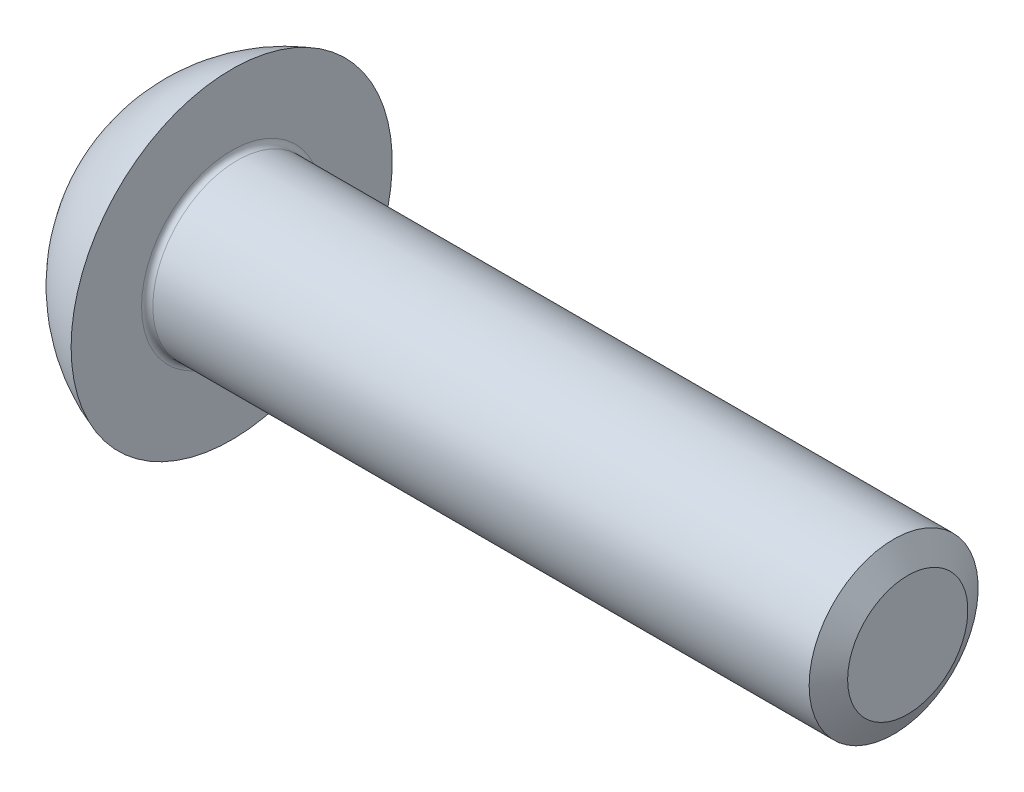
ISO-10303-21;
HEADER;
FILE_DESCRIPTION(('STEP AP214'),'2;1');
FILE_NAME('part.step','',(''),(''),'','','');
FILE_SCHEMA(('AUTOMOTIVE_DESIGN { 1 0 10303 214 1 1 1 1 }'));
ENDSEC;
DATA;
#1=APPLICATION_CONTEXT('core data for automotive mechanical design processes');
#2=APPLICATION_PROTOCOL_DEFINITION('international standard','automotive_design',2000,#1);
#3=PRODUCT_CONTEXT('',#1,'mechanical');
#4=PRODUCT('Part','Part','',(#3));
#5=PRODUCT_RELATED_PRODUCT_CATEGORY('part','',(#4));
#6=PRODUCT_DEFINITION_FORMATION('','',#4);
#7=PRODUCT_DEFINITION_CONTEXT('part definition',#1,'design');
#8=PRODUCT_DEFINITION('design','',#6,#7);
#9=PRODUCT_DEFINITION_SHAPE('','',#8);
#10=(LENGTH_UNIT() NAMED_UNIT(*) SI_UNIT(.MILLI.,.METRE.));
#11=(NAMED_UNIT(*) PLANE_ANGLE_UNIT() SI_UNIT($,.RADIAN.));
#12=(NAMED_UNIT(*) SI_UNIT($,.STERADIAN.) SOLID_ANGLE_UNIT());
#13=UNCERTAINTY_MEASURE_WITH_UNIT(LENGTH_MEASURE(1.E-05),#10,'distance_accuracy_value','');
#14=(GEOMETRIC_REPRESENTATION_CONTEXT(3) GLOBAL_UNCERTAINTY_ASSIGNED_CONTEXT((#13)) GLOBAL_UNIT_ASSIGNED_CONTEXT((#10,
#11,#12)) REPRESENTATION_CONTEXT('',''));
#15=CARTESIAN_POINT('',(0.,0.,0.));
#16=DIRECTION('',(0.,0.,1.));
#17=DIRECTION('',(1.,0.,0.));
#18=AXIS2_PLACEMENT_3D('',#15,#16,#17);
#19=CARTESIAN_POINT('',(-13.65,0.,0.));
#20=DIRECTION('',(-1.,0.,0.));
#21=DIRECTION('',(0.,0.,1.));
#22=AXIS2_PLACEMENT_3D('',#19,#20,#21);
#23=CYLINDRICAL_SURFACE('',#22,1.5);
#24=CARTESIAN_POINT('',(-11.9,0.,0.));
#25=DIRECTION('',(-1.,0.,0.));
#26=DIRECTION('',(0.,0.,1.));
#27=AXIS2_PLACEMENT_3D('',#24,#25,#26);
#28=CIRCLE('',#27,1.5);
#29=CARTESIAN_POINT('',(-11.9,0.,1.5));
#30=VERTEX_POINT('',#29);
#31=EDGE_CURVE('E262',#30,#30,#28,.T.);
#32=ORIENTED_EDGE('',*,*,#31,.F.);
#33=EDGE_LOOP('',(#32));
#34=FACE_BOUND('',#33,.T.);
#35=CARTESIAN_POINT('',(-0.25,0.,0.));
#36=DIRECTION('',(-1.,0.,0.));
#37=DIRECTION('',(0.,0.,1.));
#38=AXIS2_PLACEMENT_3D('',#35,#36,#37);
#39=CIRCLE('',#38,1.5);
#40=CARTESIAN_POINT('',(-0.25,0.,1.5));
#41=VERTEX_POINT('',#40);
#42=EDGE_CURVE('E449',#41,#41,#39,.T.);
#43=ORIENTED_EDGE('',*,*,#42,.T.);
#44=EDGE_LOOP('',(#43));
#45=FACE_BOUND('',#44,.T.);
#46=ADVANCED_FACE('F41',(#34,#45),#23,.T.);
#47=CARTESIAN_POINT('',(-13.65,0.,0.));
#48=DIRECTION('',(1.,0.,0.));
#49=DIRECTION('',(0.,0.,-1.));
#50=AXIS2_PLACEMENT_3D('',#47,#48,#49);
#51=PLANE('',#50);
#52=CARTESIAN_POINT('',(-13.65,0.,0.));
#53=DIRECTION('',(-1.,0.,0.));
#54=DIRECTION('',(0.,0.,1.));
#55=AXIS2_PLACEMENT_3D('',#52,#53,#54);
#56=CIRCLE('',#55,1.49999999999999);
#57=CARTESIAN_POINT('',(-13.65,0.,1.49999999999999));
#58=VERTEX_POINT('',#57);
#59=EDGE_CURVE('E254',#58,#58,#56,.T.);
#60=ORIENTED_EDGE('',*,*,#59,.T.);
#61=EDGE_LOOP('',(#60));
#62=FACE_BOUND('',#61,.T.);
#63=CARTESIAN_POINT('',(-13.65,0.,0.));
#64=DIRECTION('',(1.,0.,0.));
#65=DIRECTION('',(0.,0.,-1.));
#66=AXIS2_PLACEMENT_3D('',#63,#64,#65);
#67=CIRCLE('',#66,1.15470053837925);
#68=CARTESIAN_POINT('',(-13.65,-0.577350269189627,-1.));
#69=VERTEX_POINT('',#68);
#70=CARTESIAN_POINT('',(-13.65,-1.15470053837925,0.));
#71=VERTEX_POINT('',#70);
#72=EDGE_CURVE('E11',#69,#71,#67,.F.);
#73=ORIENTED_EDGE('',*,*,#72,.F.);
#74=CARTESIAN_POINT('',(-13.65,0.577350269189628,-1.));
#75=VERTEX_POINT('',#74);
#76=EDGE_CURVE('E45',#75,#69,#67,.F.);
#77=ORIENTED_EDGE('',*,*,#76,.F.);
#78=CARTESIAN_POINT('',(-13.65,1.15470053837925,0.));
#79=VERTEX_POINT('',#78);
#80=EDGE_CURVE('E114',#79,#75,#67,.F.);
#81=ORIENTED_EDGE('',*,*,#80,.F.);
#82=CARTESIAN_POINT('',(-13.65,0.577350269189629,1.));
#83=VERTEX_POINT('',#82);
#84=EDGE_CURVE('E327',#83,#79,#67,.F.);
#85=ORIENTED_EDGE('',*,*,#84,.F.);
#86=CARTESIAN_POINT('',(-13.65,-0.577350269189641,0.999999999999994));
#87=VERTEX_POINT('',#86);
#88=EDGE_CURVE('E50',#87,#83,#67,.F.);
#89=ORIENTED_EDGE('',*,*,#88,.F.);
#90=CARTESIAN_POINT('',(-13.65,0.,0.));
#91=DIRECTION('',(-1.,0.,0.));
#92=DIRECTION('',(0.,-1.,0.));
#93=AXIS2_PLACEMENT_3D('',#90,#91,#92);
#94=CIRCLE('',#93,1.15470053837925);
#95=EDGE_CURVE('E117',#71,#87,#94,.T.);
#96=ORIENTED_EDGE('',*,*,#95,.F.);
#97=EDGE_LOOP('',(#73,#77,#81,#85,#89,#96));
#98=FACE_BOUND('',#97,.T.);
#99=ADVANCED_FACE('F43',(#62,#98),#51,.F.);
#100=CARTESIAN_POINT('',(-11.0454545454545,0.,0.));
#101=DIRECTION('',(-1.,0.,0.));
#102=DIRECTION('',(0.,1.,0.));
#103=AXIS2_PLACEMENT_3D('',#100,#101,#102);
#104=SPHERICAL_SURFACE('',#103,3.00560426949281);
#105=ORIENTED_EDGE('',*,*,#59,.F.);
#106=EDGE_LOOP('',(#105));
#107=FACE_BOUND('',#106,.T.);
#108=CARTESIAN_POINT('',(-12.,0.,0.));
#109=DIRECTION('',(-1.,0.,0.));
#110=DIRECTION('',(0.,0.,1.));
#111=AXIS2_PLACEMENT_3D('',#108,#109,#110);
#112=CIRCLE('',#111,2.85);
#113=CARTESIAN_POINT('',(-12.,0.,2.85));
#114=VERTEX_POINT('',#113);
#115=EDGE_CURVE('E257',#114,#114,#112,.T.);
#116=ORIENTED_EDGE('',*,*,#115,.T.);
#117=EDGE_LOOP('',(#116));
#118=FACE_BOUND('',#117,.T.);
#119=ADVANCED_FACE('F243',(#107,#118),#104,.T.);
#120=CARTESIAN_POINT('',(-12.,1.6,0.));
#121=DIRECTION('',(-1.,0.,0.));
#122=DIRECTION('',(0.,0.,1.));
#123=AXIS2_PLACEMENT_3D('',#120,#121,#122);
#124=PLANE('',#123);
#125=ORIENTED_EDGE('',*,*,#115,.F.);
#126=EDGE_LOOP('',(#125));
#127=FACE_BOUND('',#126,.T.);
#128=CARTESIAN_POINT('',(-12.,0.,0.));
#129=DIRECTION('',(-1.,0.,0.));
#130=DIRECTION('',(0.,0.,1.));
#131=AXIS2_PLACEMENT_3D('',#128,#129,#130);
#132=CIRCLE('',#131,1.6);
#133=CARTESIAN_POINT('',(-12.,0.,1.6));
#134=VERTEX_POINT('',#133);
#135=EDGE_CURVE('E258',#134,#134,#132,.T.);
#136=ORIENTED_EDGE('',*,*,#135,.T.);
#137=EDGE_LOOP('',(#136));
#138=FACE_BOUND('',#137,.T.);
#139=ADVANCED_FACE('F240',(#127,#138),#124,.F.);
#140=CARTESIAN_POINT('',(-11.9,0.,0.));
#141=DIRECTION('',(-1.,0.,0.));
#142=DIRECTION('',(0.,0.,1.));
#143=AXIS2_PLACEMENT_3D('',#140,#141,#142);
#144=TOROIDAL_SURFACE('',#143,1.6,0.100000000000001);
#145=ORIENTED_EDGE('',*,*,#135,.F.);
#146=EDGE_LOOP('',(#145));
#147=FACE_BOUND('',#146,.T.);
#148=ORIENTED_EDGE('',*,*,#31,.T.);
#149=EDGE_LOOP('',(#148));
#150=FACE_BOUND('',#149,.T.);
#151=ADVANCED_FACE('F237',(#147,#150),#144,.F.);
#152=CARTESIAN_POINT('',(-13.35,0.,0.));
#153=DIRECTION('',(-1.,0.,0.));
#154=DIRECTION('',(0.,-1.,0.));
#155=AXIS2_PLACEMENT_3D('',#152,#153,#154);
#156=CONICAL_SURFACE('',#155,0.,1.31660847419537);
#157=CARTESIAN_POINT('',(-13.8201338061757,-1.50813004503231,-1.));
#158=CARTESIAN_POINT('',(-13.8103550434582,-1.46296169551439,-1.));
#159=CARTESIAN_POINT('',(-13.8007010634319,-1.41776633015547,-1.));
#160=CARTESIAN_POINT('',(-13.7817057249496,-1.32730802004726,-1.));
#161=CARTESIAN_POINT('',(-13.7723643798043,-1.28204507250605,-1.));
#162=CARTESIAN_POINT('',(-13.744887707109,-1.1460540932135,-1.));
#163=CARTESIAN_POINT('',(-13.727318593487,-1.05520983554783,-1.));
#164=CARTESIAN_POINT('',(-13.6946113120355,-0.873838301527071,-1.));
#165=CARTESIAN_POINT('',(-13.6794545669183,-0.783314439111171,-1.));
#166=CARTESIAN_POINT('',(-13.6526000869216,-0.601754544937859,-1.));
#167=CARTESIAN_POINT('',(-13.6409016960468,-0.510718613654571,-1.));
#168=CARTESIAN_POINT('',(-13.6224688104588,-0.327147289363389,-1.));
#169=CARTESIAN_POINT('',(-13.615787761882,-0.234606191530867,-1.));
#170=CARTESIAN_POINT('',(-13.6090368362792,-0.0493046546038913,-1.));
#171=CARTESIAN_POINT('',(-13.6089640024594,0.0434556678202338,-1.));
#172=CARTESIAN_POINT('',(-13.6154534933963,0.229083736297408,-1.));
#173=CARTESIAN_POINT('',(-13.6220414736928,0.321950510989412,-1.));
#174=CARTESIAN_POINT('',(-13.6404572139866,0.507192547661322,-1.));
#175=CARTESIAN_POINT('',(-13.6522884816114,0.599567438647767,-1.));
#176=CARTESIAN_POINT('',(-13.6798118313046,0.785811374344476,-1.));
#177=CARTESIAN_POINT('',(-13.6955836030667,0.879668210998828,-1.));
#178=CARTESIAN_POINT('',(-13.7295232966728,1.06695285350417,-1.));
#179=CARTESIAN_POINT('',(-13.7476915787193,1.16038059267178,-1.));
#180=CARTESIAN_POINT('',(-13.7855853163011,1.34694314919726,-1.));
#181=CARTESIAN_POINT('',(-13.8053112029702,1.44007787798179,-1.));
#182=CARTESIAN_POINT('',(-13.8457971322914,1.62612272763756,-1.));
#183=CARTESIAN_POINT('',(-13.866557196056,1.71903284388274,-1.));
#184=CARTESIAN_POINT('',(-13.9085485742601,1.90363742744432,-1.));
#185=CARTESIAN_POINT('',(-13.9297718689088,1.99533372655926,-1.));
#186=CARTESIAN_POINT('',(-13.9727143057913,2.17861191601367,-1.));
#187=CARTESIAN_POINT('',(-13.9944334585808,2.27019380387373,-1.));
#188=CARTESIAN_POINT('',(-14.0382042420233,2.45314970796374,-1.));
#189=CARTESIAN_POINT('',(-14.0602553943374,2.54452383886909,-1.));
#190=CARTESIAN_POINT('',(-14.1046332471854,2.72720190599484,-1.));
#191=CARTESIAN_POINT('',(-14.1269599382911,2.81850584450412,-1.));
#192=CARTESIAN_POINT('',(-14.1493826695211,2.90978592143881,-1.));
#193=B_SPLINE_CURVE_WITH_KNOTS('',3,(#157,#158,#159,#160,#161,#162,#163,#164,#165,#166,#167,
#168,#169,#170,#171,#172,#173,#174,#175,#176,#177,#178,#179,#180,#181,#182,#183,#184,#185,#186,
#187,#188,#189,#190,#191,#192),.UNSPECIFIED.,.F.,.F.,(4,2,2,2,2,2,2,2,2,2,2,2,2,2,2,2,2,4),(0.,
0.138643869889783,0.277293635233154,0.554857004517545,0.830167022781709,1.10542478551795,
1.38357462934898,1.66160001660696,1.94070037269332,2.2199877224158,2.50545939030146,
2.7909740144124,3.07656794584653,3.36216771000262,3.64452690710854,3.92689212062336,
4.20888343548739,4.49086512790399),.UNSPECIFIED.);
#194=EDGE_CURVE('E105',#69,#75,#193,.T.);
#195=ORIENTED_EDGE('',*,*,#194,.T.);
#196=ORIENTED_EDGE('',*,*,#76,.T.);
#197=EDGE_LOOP('',(#195,#196));
#198=FACE_BOUND('',#197,.T.);
#199=ADVANCED_FACE('F109',(#198),#156,.F.);
#200=CARTESIAN_POINT('',(-13.6500300044995,0.57723479913579,-1.0002));
#201=CARTESIAN_POINT('',(-13.6437929192042,0.601225021738601,-0.958647715567045));
#202=CARTESIAN_POINT('',(-13.6381313786167,0.625256195021442,-0.917024502475672));
#203=CARTESIAN_POINT('',(-13.6281854217223,0.673398386330441,-0.833639781140785));
#204=CARTESIAN_POINT('',(-13.6239015302713,0.697509431260086,-0.791878226299065));
#205=CARTESIAN_POINT('',(-13.6169589031667,0.745673772514857,-0.708455140132715));
#206=CARTESIAN_POINT('',(-13.6142923745456,0.769726780462719,-0.66679410829216));
#207=CARTESIAN_POINT('',(-13.6107168929941,0.817861664223351,-0.583422044002323));
#208=CARTESIAN_POINT('',(-13.6098076211353,0.841943534003896,-0.541711022001162));
#209=CARTESIAN_POINT('',(-13.6098076211353,0.890107273564986,-0.458288977998839));
#210=CARTESIAN_POINT('',(-13.6107168929941,0.914189143345531,-0.416577955997678));
#211=CARTESIAN_POINT('',(-13.6142923745456,0.962324027106163,-0.333205891707841));
#212=CARTESIAN_POINT('',(-13.6169589031667,0.986377035054025,-0.291544859867287));
#213=CARTESIAN_POINT('',(-13.6239015302713,1.0345413763088,-0.208121773700937));
#214=CARTESIAN_POINT('',(-13.6281854217223,1.05865242123844,-0.166360218859216));
#215=CARTESIAN_POINT('',(-13.6381313786167,1.10679461254744,-0.0829754975243295));
#216=CARTESIAN_POINT('',(-13.6437929192042,1.13082578583028,-0.0413522844329567));
#217=CARTESIAN_POINT('',(-13.6500300044995,1.15481600843309,0.000199999999999243));
#218=B_SPLINE_CURVE_WITH_KNOTS('',3,(#200,#201,#202,#203,#204,#205,#206,#207,#208,#209,#210,
#211,#212,#213,#214,#215,#216,#217),.UNSPECIFIED.,.F.,.F.,(4,2,2,2,2,2,2,2,4),(0.,
0.145159524820138,0.290374287087485,0.43488368212285,0.579366847367631,0.723850012612412,
0.868359407647777,1.01357416991512,1.15873369473526),.UNSPECIFIED.);
#219=EDGE_CURVE('E133',#75,#79,#218,.T.);
#220=ORIENTED_EDGE('',*,*,#219,.T.);
#221=ORIENTED_EDGE('',*,*,#80,.T.);
#222=EDGE_LOOP('',(#220,#221));
#223=FACE_BOUND('',#222,.T.);
#224=ADVANCED_FACE('F161',(#223),#156,.F.);
#225=CARTESIAN_POINT('',(-13.6500300044995,1.15481600843309,-0.000200000000000797));
#226=CARTESIAN_POINT('',(-13.6437929192042,1.13082578583028,0.0413522844329553));
#227=CARTESIAN_POINT('',(-13.6381313786167,1.10679461254744,0.0829754975243281));
#228=CARTESIAN_POINT('',(-13.6281854217223,1.05865242123844,0.166360218859215));
#229=CARTESIAN_POINT('',(-13.6239015302713,1.0345413763088,0.208121773700935));
#230=CARTESIAN_POINT('',(-13.6169589031667,0.986377035054025,0.291544859867285));
#231=CARTESIAN_POINT('',(-13.6142923745456,0.962324027106163,0.33320589170784));
#232=CARTESIAN_POINT('',(-13.6107168929941,0.914189143345531,0.416577955997676));
#233=CARTESIAN_POINT('',(-13.6098076211353,0.890107273564986,0.458288977998838));
#234=CARTESIAN_POINT('',(-13.6098076211353,0.841943534003896,0.541711022001161));
#235=CARTESIAN_POINT('',(-13.6107168929941,0.817861664223351,0.583422044002322));
#236=CARTESIAN_POINT('',(-13.6142923745456,0.769726780462719,0.666794108292158));
#237=CARTESIAN_POINT('',(-13.6169589031667,0.745673772514857,0.708455140132713));
#238=CARTESIAN_POINT('',(-13.6239015302713,0.697509431260086,0.791878226299063));
#239=CARTESIAN_POINT('',(-13.6281854217223,0.673398386330441,0.833639781140784));
#240=CARTESIAN_POINT('',(-13.6381313786167,0.625256195021442,0.91702450247567));
#241=CARTESIAN_POINT('',(-13.6437929192042,0.601225021738601,0.958647715567043));
#242=CARTESIAN_POINT('',(-13.6500300044995,0.57723479913579,1.0002));
#243=B_SPLINE_CURVE_WITH_KNOTS('',3,(#225,#226,#227,#228,#229,#230,#231,#232,#233,#234,#235,
#236,#237,#238,#239,#240,#241,#242),.UNSPECIFIED.,.F.,.F.,(4,2,2,2,2,2,2,2,4),(0.,
0.145159524820137,0.290374287087485,0.43488368212285,0.579366847367631,0.723850012612412,
0.868359407647777,1.01357416991512,1.15873369473526),.UNSPECIFIED.);
#244=EDGE_CURVE('E183',#79,#83,#243,.T.);
#245=ORIENTED_EDGE('',*,*,#244,.T.);
#246=ORIENTED_EDGE('',*,*,#84,.T.);
#247=EDGE_LOOP('',(#245,#246));
#248=FACE_BOUND('',#247,.T.);
#249=ADVANCED_FACE('F155',(#248),#156,.F.);
#250=CARTESIAN_POINT('',(-13.8201338061757,-1.50813004503231,0.999999999999999));
#251=CARTESIAN_POINT('',(-13.8103550434582,-1.46296169551439,0.999999999999999));
#252=CARTESIAN_POINT('',(-13.8007010634319,-1.41776633015547,0.999999999999999));
#253=CARTESIAN_POINT('',(-13.7817057249496,-1.32730802004726,0.999999999999999));
#254=CARTESIAN_POINT('',(-13.7723643798043,-1.28204507250605,0.999999999999999));
#255=CARTESIAN_POINT('',(-13.744887707109,-1.1460540932135,0.999999999999999));
#256=CARTESIAN_POINT('',(-13.727318593487,-1.05520983554783,0.999999999999999));
#257=CARTESIAN_POINT('',(-13.6946113120355,-0.873838301527072,0.999999999999999));
#258=CARTESIAN_POINT('',(-13.6794545669183,-0.783314439111172,0.999999999999999));
#259=CARTESIAN_POINT('',(-13.6526000869216,-0.60175454493786,0.999999999999999));
#260=CARTESIAN_POINT('',(-13.6409016960468,-0.510718613654572,0.999999999999999));
#261=CARTESIAN_POINT('',(-13.6224688104588,-0.32714728936339,0.999999999999999));
#262=CARTESIAN_POINT('',(-13.615787761882,-0.234606191530868,0.999999999999999));
#263=CARTESIAN_POINT('',(-13.6090368362792,-0.049304654603892,0.999999999999999));
#264=CARTESIAN_POINT('',(-13.6089640024594,0.043455667820233,0.999999999999999));
#265=CARTESIAN_POINT('',(-13.6154534933963,0.229083736297407,0.999999999999999));
#266=CARTESIAN_POINT('',(-13.6220414736928,0.321950510989411,0.999999999999999));
#267=CARTESIAN_POINT('',(-13.6404572139866,0.507192547661321,0.999999999999999));
#268=CARTESIAN_POINT('',(-13.6522884816114,0.599567438647766,0.999999999999999));
#269=CARTESIAN_POINT('',(-13.6798118313046,0.785811374344476,0.999999999999999));
#270=CARTESIAN_POINT('',(-13.6955836030667,0.879668210998828,0.999999999999999));
#271=CARTESIAN_POINT('',(-13.7295232966728,1.06695285350417,0.999999999999999));
#272=CARTESIAN_POINT('',(-13.7476915787193,1.16038059267178,0.999999999999999));
#273=CARTESIAN_POINT('',(-13.7855853163011,1.34694314919726,0.999999999999999));
#274=CARTESIAN_POINT('',(-13.8053112029702,1.44007787798179,0.999999999999999));
#275=CARTESIAN_POINT('',(-13.8457971322914,1.62612272763756,0.999999999999999));
#276=CARTESIAN_POINT('',(-13.866557196056,1.71903284388274,0.999999999999999));
#277=CARTESIAN_POINT('',(-13.9085485742601,1.90363742744432,0.999999999999999));
#278=CARTESIAN_POINT('',(-13.9297718689088,1.99533372655926,0.999999999999999));
#279=CARTESIAN_POINT('',(-13.9727143057913,2.17861191601367,0.999999999999999));
#280=CARTESIAN_POINT('',(-13.9944334585808,2.27019380387373,0.999999999999999));
#281=CARTESIAN_POINT('',(-14.0382042420233,2.45314970796374,0.999999999999999));
#282=CARTESIAN_POINT('',(-14.0602553943374,2.54452383886909,0.999999999999999));
#283=CARTESIAN_POINT('',(-14.1046332471854,2.72720190599484,0.999999999999999));
#284=CARTESIAN_POINT('',(-14.1269599382911,2.81850584450412,0.999999999999999));
#285=CARTESIAN_POINT('',(-14.1493826695211,2.90978592143881,0.999999999999999));
#286=B_SPLINE_CURVE_WITH_KNOTS('',3,(#250,#251,#252,#253,#254,#255,#256,#257,#258,#259,#260,
#261,#262,#263,#264,#265,#266,#267,#268,#269,#270,#271,#272,#273,#274,#275,#276,#277,#278,#279,
#280,#281,#282,#283,#284,#285),.UNSPECIFIED.,.F.,.F.,(4,2,2,2,2,2,2,2,2,2,2,2,2,2,2,2,2,4),(0.,
0.138643869889783,0.277293635233154,0.554857004517545,0.830167022781708,1.10542478551795,
1.38357462934898,1.66160001660696,1.94070037269332,2.2199877224158,2.50545939030146,
2.7909740144124,3.07656794584653,3.36216771000262,3.64452690710854,3.92689212062336,
4.20888343548739,4.49086512790399),.UNSPECIFIED.);
#287=EDGE_CURVE('E62',#83,#87,#286,.F.);
#288=ORIENTED_EDGE('',*,*,#287,.T.);
#289=ORIENTED_EDGE('',*,*,#88,.T.);
#290=EDGE_LOOP('',(#288,#289));
#291=FACE_BOUND('',#290,.T.);
#292=ADVANCED_FACE('F160',(#291),#156,.F.);
#293=CARTESIAN_POINT('',(-13.6500300044995,-0.577234799135789,1.0002));
#294=CARTESIAN_POINT('',(-13.6437929192042,-0.6012250217386,0.958647715567043));
#295=CARTESIAN_POINT('',(-13.6381313786167,-0.625256195021441,0.91702450247567));
#296=CARTESIAN_POINT('',(-13.6281854217223,-0.67339838633044,0.833639781140783));
#297=CARTESIAN_POINT('',(-13.6239015302713,-0.697509431260084,0.791878226299063));
#298=CARTESIAN_POINT('',(-13.6169589031667,-0.745673772514856,0.708455140132713));
#299=CARTESIAN_POINT('',(-13.6142923745456,-0.769726780462718,0.666794108292159));
#300=CARTESIAN_POINT('',(-13.6107168929941,-0.81786166422335,0.583422044002322));
#301=CARTESIAN_POINT('',(-13.6098076211353,-0.841943534003895,0.541711022001161));
#302=CARTESIAN_POINT('',(-13.6098076211353,-0.890107273564984,0.458288977998838));
#303=CARTESIAN_POINT('',(-13.6107168929941,-0.914189143345529,0.416577955997676));
#304=CARTESIAN_POINT('',(-13.6142923745456,-0.962324027106161,0.33320589170784));
#305=CARTESIAN_POINT('',(-13.6169589031667,-0.986377035054023,0.291544859867285));
#306=CARTESIAN_POINT('',(-13.6239015302713,-1.03454137630879,0.208121773700935));
#307=CARTESIAN_POINT('',(-13.6281854217223,-1.05865242123844,0.166360218859215));
#308=CARTESIAN_POINT('',(-13.6381313786167,-1.10679461254744,0.0829754975243279));
#309=CARTESIAN_POINT('',(-13.6437929192042,-1.13082578583028,0.0413522844329552));
#310=CARTESIAN_POINT('',(-13.6500300044995,-1.15481600843309,-0.000200000000000704));
#311=B_SPLINE_CURVE_WITH_KNOTS('',3,(#293,#294,#295,#296,#297,#298,#299,#300,#301,#302,#303,
#304,#305,#306,#307,#308,#309,#310),.UNSPECIFIED.,.F.,.F.,(4,2,2,2,2,2,2,2,4),(0.,
0.145159524820137,0.290374287087485,0.434883682122849,0.579366847367631,0.723850012612412,
0.868359407647777,1.01357416991512,1.15873369473526),.UNSPECIFIED.);
#312=EDGE_CURVE('E56',#87,#71,#311,.T.);
#313=ORIENTED_EDGE('',*,*,#312,.T.);
#314=ORIENTED_EDGE('',*,*,#95,.T.);
#315=EDGE_LOOP('',(#313,#314));
#316=FACE_BOUND('',#315,.T.);
#317=ADVANCED_FACE('F314',(#316),#156,.F.);
#318=CARTESIAN_POINT('',(-13.6500300044995,-1.15481600843309,0.0001999999999991));
#319=CARTESIAN_POINT('',(-13.6437929192042,-1.13082578583028,-0.0413522844329567));
#320=CARTESIAN_POINT('',(-13.6381313786167,-1.10679461254744,-0.0829754975243295));
#321=CARTESIAN_POINT('',(-13.6281854217223,-1.05865242123844,-0.166360218859216));
#322=CARTESIAN_POINT('',(-13.6239015302713,-1.03454137630879,-0.208121773700937));
#323=CARTESIAN_POINT('',(-13.6169589031667,-0.986377035054023,-0.291544859867287));
#324=CARTESIAN_POINT('',(-13.6142923745456,-0.962324027106161,-0.333205891707842));
#325=CARTESIAN_POINT('',(-13.6107168929941,-0.914189143345529,-0.416577955997678));
#326=CARTESIAN_POINT('',(-13.6098076211353,-0.890107273564984,-0.45828897799884));
#327=CARTESIAN_POINT('',(-13.6098076211353,-0.841943534003894,-0.541711022001162));
#328=CARTESIAN_POINT('',(-13.6107168929941,-0.817861664223349,-0.583422044002324));
#329=CARTESIAN_POINT('',(-13.6142923745456,-0.769726780462717,-0.66679410829216));
#330=CARTESIAN_POINT('',(-13.6169589031667,-0.745673772514855,-0.708455140132715));
#331=CARTESIAN_POINT('',(-13.6239015302713,-0.697509431260084,-0.791878226299065));
#332=CARTESIAN_POINT('',(-13.6281854217223,-0.673398386330439,-0.833639781140785));
#333=CARTESIAN_POINT('',(-13.6381313786167,-0.625256195021441,-0.917024502475672));
#334=CARTESIAN_POINT('',(-13.6437929192042,-0.601225021738599,-0.958647715567045));
#335=CARTESIAN_POINT('',(-13.6500300044995,-0.577234799135788,-1.0002));
#336=B_SPLINE_CURVE_WITH_KNOTS('',3,(#318,#319,#320,#321,#322,#323,#324,#325,#326,#327,#328,
#329,#330,#331,#332,#333,#334,#335),.UNSPECIFIED.,.F.,.F.,(4,2,2,2,2,2,2,2,4),(0.,
0.145159524820137,0.290374287087485,0.43488368212285,0.579366847367631,0.723850012612412,
0.868359407647777,1.01357416991512,1.15873369473526),.UNSPECIFIED.);
#337=EDGE_CURVE('E97',#71,#69,#336,.T.);
#338=ORIENTED_EDGE('',*,*,#337,.T.);
#339=ORIENTED_EDGE('',*,*,#72,.T.);
#340=EDGE_LOOP('',(#338,#339));
#341=FACE_BOUND('',#340,.T.);
#342=ADVANCED_FACE('F99',(#341),#156,.F.);
#343=CARTESIAN_POINT('',(-12.61,0.,0.));
#344=DIRECTION('',(-1.,0.,0.));
#345=DIRECTION('',(0.,0.,1.));
#346=AXIS2_PLACEMENT_3D('',#343,#344,#345);
#347=CONICAL_SURFACE('',#346,1.15470053837925,1.08478502970568);
#348=CARTESIAN_POINT('',(-12.,0.,0.));
#349=VERTEX_POINT('',#348);
#350=VERTEX_LOOP('',#349);
#351=FACE_BOUND('',#350,.T.);
#352=CARTESIAN_POINT('',(-12.9533777683403,-1.50230992873526,0.999999999999999));
#353=CARTESIAN_POINT('',(-12.9340444769777,-1.45833854185076,0.999999999999999));
#354=CARTESIAN_POINT('',(-12.9149232467737,-1.41427434344668,0.999999999999999));
#355=CARTESIAN_POINT('',(-12.8772163059513,-1.32590919920826,0.999999999999999));
#356=CARTESIAN_POINT('',(-12.8586306830292,-1.28160821599644,0.999999999999999));
#357=CARTESIAN_POINT('',(-12.8036681478386,-1.14784319726152,0.999999999999999));
#358=CARTESIAN_POINT('',(-12.7682844804861,-1.05796321251933,0.999999999999999));
#359=CARTESIAN_POINT('',(-12.7014887265583,-0.876123438160723,0.999999999999999));
#360=CARTESIAN_POINT('',(-12.670100993813,-0.784154578942252,0.999999999999999));
#361=CARTESIAN_POINT('',(-12.6142698926597,-0.598229842457833,0.999999999999999));
#362=CARTESIAN_POINT('',(-12.5898112637181,-0.504278829186388,0.999999999999999));
#363=CARTESIAN_POINT('',(-12.561284211292,-0.361662527207036,0.999999999999999));
#364=CARTESIAN_POINT('',(-12.5531336537351,-0.313821896859327,0.999999999999999));
#365=CARTESIAN_POINT('',(-12.5400901383612,-0.217683951682428,0.999999999999999));
#366=CARTESIAN_POINT('',(-12.5351973854909,-0.169386608315469,0.999999999999999));
#367=CARTESIAN_POINT('',(-12.5290689217004,-0.0727543492205677,0.999999999999999));
#368=CARTESIAN_POINT('',(-12.5278181907857,-0.0244204124532973,0.999999999999999));
#369=CARTESIAN_POINT('',(-12.5290340461929,0.0721832270827322,0.999999999999999));
#370=CARTESIAN_POINT('',(-12.5314996115354,0.120452943848545,0.999999999999999));
#371=CARTESIAN_POINT('',(-12.5426858199704,0.247728096968902,0.999999999999999));
#372=CARTESIAN_POINT('',(-12.554415626327,0.326472817075773,0.999999999999999));
#373=CARTESIAN_POINT('',(-12.5853155073204,0.482611029430836,0.999999999999999));
#374=CARTESIAN_POINT('',(-12.6045054158237,0.560000340052678,0.999999999999999));
#375=CARTESIAN_POINT('',(-12.6484420949321,0.71486851606165,0.999999999999999));
#376=CARTESIAN_POINT('',(-12.6732951431871,0.792316418029713,0.999999999999999));
#377=CARTESIAN_POINT('',(-12.7131493499715,0.907307575681687,0.999999999999999));
#378=CARTESIAN_POINT('',(-12.7268173023165,0.945326191835172,0.999999999999999));
#379=CARTESIAN_POINT('',(-12.7548765004687,1.02108213718649,0.999999999999999));
#380=CARTESIAN_POINT('',(-12.7692675113704,1.05881955322303,0.999999999999999));
#381=CARTESIAN_POINT('',(-12.783948942311,1.09644387703731,0.999999999999999));
#382=B_SPLINE_CURVE_WITH_KNOTS('',3,(#352,#353,#354,#355,#356,#357,#358,#359,#360,#361,#362,
#363,#364,#365,#366,#367,#368,#369,#370,#371,#372,#373,#374,#375,#376,#377,#378,#379,#380,#381),
.UNSPECIFIED.,.F.,.F.,(4,2,2,2,2,2,2,2,2,2,2,2,2,2,4),(0.,0.144099688332553,0.288222837954159,
0.577934102924426,0.869334177214382,1.16008739746132,1.30558498590577,1.45109172666276,
1.59599752995898,1.74086353048646,1.97918576956974,2.21814600788027,2.46202630637786,
2.58322416173438,2.70438289404452),.UNSPECIFIED.);
#383=CARTESIAN_POINT('',(-12.61,-0.577350269189627,0.999999999999999));
#384=VERTEX_POINT('',#383);
#385=CARTESIAN_POINT('',(-12.61,0.577350269189628,0.999999999999999));
#386=VERTEX_POINT('',#385);
#387=EDGE_CURVE('E199',#384,#386,#382,.T.);
#388=ORIENTED_EDGE('',*,*,#387,.T.);
#389=CARTESIAN_POINT('',(-12.6100610091491,0.57723479913579,1.0002));
#390=CARTESIAN_POINT('',(-12.5967471675624,0.602421402936659,0.956575522546787));
#391=CARTESIAN_POINT('',(-12.5846484366665,0.627789970277027,0.912635874998038));
#392=CARTESIAN_POINT('',(-12.5635159299897,0.678892423428092,0.824123829748984));
#393=CARTESIAN_POINT('',(-12.5544881451853,0.704626922430508,0.77955036996947));
#394=CARTESIAN_POINT('',(-12.5403368995943,0.755829480104159,0.690864938601231));
#395=CARTESIAN_POINT('',(-12.5351365451759,0.78129204013318,0.646762490940193));
#396=CARTESIAN_POINT('',(-12.5287989102245,0.832321934515701,0.558376121164793));
#397=CARTESIAN_POINT('',(-12.527657647587,0.857889141534311,0.514092419600929));
#398=CARTESIAN_POINT('',(-12.5294293203474,0.906140287040708,0.430518984060451));
#399=CARTESIAN_POINT('',(-12.5319054116845,0.928828599718462,0.391221673764572));
#400=CARTESIAN_POINT('',(-12.5399567288674,0.974082594298357,0.312839455906748));
#401=CARTESIAN_POINT('',(-12.5455343304689,0.996648168786446,0.273754734391397));
#402=CARTESIAN_POINT('',(-12.5595556697914,1.04198502975731,0.195228987734173));
#403=CARTESIAN_POINT('',(-12.5680513970794,1.06475218926301,0.155795110726276));
#404=CARTESIAN_POINT('',(-12.5874031221558,1.1099976059254,0.0774277502573916));
#405=CARTESIAN_POINT('',(-12.5982552609432,1.13247627253034,0.0384935576112343));
#406=CARTESIAN_POINT('',(-12.6100610091491,1.15481600843309,-0.000200000000000836));
#407=B_SPLINE_CURVE_WITH_KNOTS('',3,(#389,#390,#391,#392,#393,#394,#395,#396,#397,#398,#399,
#400,#401,#402,#403,#404,#405,#406),.UNSPECIFIED.,.F.,.F.,(4,2,2,2,2,2,2,2,4),(0.,
0.156356652206859,0.313016607627113,0.466436255933324,0.619705352863253,0.755925705289371,
0.892250546480128,1.03114227500706,1.16980823889878),.UNSPECIFIED.);
#408=CARTESIAN_POINT('',(-12.61,1.15470053837925,0.));
#409=VERTEX_POINT('',#408);
#410=EDGE_CURVE('E207',#386,#409,#407,.T.);
#411=ORIENTED_EDGE('',*,*,#410,.T.);
#412=CARTESIAN_POINT('',(-12.6100610091491,1.15481600843309,0.000199999999999198));
#413=CARTESIAN_POINT('',(-12.5967471675624,1.12962940463222,-0.0434244774532135));
#414=CARTESIAN_POINT('',(-12.5846484366665,1.10426083729186,-0.0873641250019624));
#415=CARTESIAN_POINT('',(-12.5635159299897,1.05315838414079,-0.175876170251017));
#416=CARTESIAN_POINT('',(-12.5544881451853,1.02742388513837,-0.220449630030531));
#417=CARTESIAN_POINT('',(-12.5403368995943,0.976221327464723,-0.30913506139877));
#418=CARTESIAN_POINT('',(-12.5351365451759,0.950758767435702,-0.353237509059808));
#419=CARTESIAN_POINT('',(-12.5287989102245,0.89972887305318,-0.441623878835209));
#420=CARTESIAN_POINT('',(-12.527657647587,0.87416166603457,-0.485907580399073));
#421=CARTESIAN_POINT('',(-12.5294293203474,0.825910520528173,-0.56948101593955));
#422=CARTESIAN_POINT('',(-12.5319054116845,0.80322220785042,-0.608778326235429));
#423=CARTESIAN_POINT('',(-12.5399567288674,0.757968213270525,-0.687160544093253));
#424=CARTESIAN_POINT('',(-12.5455343304689,0.735402638782435,-0.726245265608604));
#425=CARTESIAN_POINT('',(-12.5595556697914,0.690065777811571,-0.804771012265827));
#426=CARTESIAN_POINT('',(-12.5680513970794,0.667298618305871,-0.844204889273724));
#427=CARTESIAN_POINT('',(-12.5874031221558,0.622053201643481,-0.922572249742608));
#428=CARTESIAN_POINT('',(-12.5982552609432,0.599574535038541,-0.961506442388766));
#429=CARTESIAN_POINT('',(-12.6100610091491,0.57723479913579,-1.0002));
#430=B_SPLINE_CURVE_WITH_KNOTS('',3,(#412,#413,#414,#415,#416,#417,#418,#419,#420,#421,#422,
#423,#424,#425,#426,#427,#428,#429),.UNSPECIFIED.,.F.,.F.,(4,2,2,2,2,2,2,2,4),(0.,
0.156356652206859,0.313016607627114,0.466436255933326,0.619705352863255,0.755925705289372,
0.892250546480129,1.03114227500706,1.16980823889878),.UNSPECIFIED.);
#431=CARTESIAN_POINT('',(-12.61,0.577350269189627,-1.));
#432=VERTEX_POINT('',#431);
#433=EDGE_CURVE('E115',#409,#432,#430,.T.);
#434=ORIENTED_EDGE('',*,*,#433,.T.);
#435=CARTESIAN_POINT('',(-12.9533777683403,-1.50230992873525,-1.));
#436=CARTESIAN_POINT('',(-12.9340444769777,-1.45833854185076,-1.));
#437=CARTESIAN_POINT('',(-12.9149232467738,-1.41427434344668,-1.));
#438=CARTESIAN_POINT('',(-12.8772163059513,-1.32590919920826,-1.));
#439=CARTESIAN_POINT('',(-12.8586306830292,-1.28160821599644,-1.));
#440=CARTESIAN_POINT('',(-12.8036681478386,-1.14784319726152,-1.));
#441=CARTESIAN_POINT('',(-12.7682844804861,-1.05796321251933,-1.));
#442=CARTESIAN_POINT('',(-12.7014887265583,-0.876123438160721,-1.));
#443=CARTESIAN_POINT('',(-12.670100993813,-0.784154578942249,-1.));
#444=CARTESIAN_POINT('',(-12.6142698926597,-0.598229842457831,-1.));
#445=CARTESIAN_POINT('',(-12.5898112637181,-0.504278829186387,-1.));
#446=CARTESIAN_POINT('',(-12.561284211292,-0.361662527207035,-1.));
#447=CARTESIAN_POINT('',(-12.5531336537351,-0.313821896859326,-1.));
#448=CARTESIAN_POINT('',(-12.5400901383612,-0.217683951682427,-1.));
#449=CARTESIAN_POINT('',(-12.5351973854909,-0.169386608315468,-1.));
#450=CARTESIAN_POINT('',(-12.5290689217004,-0.0727543492205669,-1.));
#451=CARTESIAN_POINT('',(-12.5278181907857,-0.0244204124532966,-1.));
#452=CARTESIAN_POINT('',(-12.5290340461929,0.0721832270827327,-1.));
#453=CARTESIAN_POINT('',(-12.5314996115354,0.120452943848545,-1.));
#454=CARTESIAN_POINT('',(-12.5426858199704,0.247728096968902,-1.));
#455=CARTESIAN_POINT('',(-12.554415626327,0.326472817075773,-1.));
#456=CARTESIAN_POINT('',(-12.5853155073204,0.482611029430837,-1.));
#457=CARTESIAN_POINT('',(-12.6045054158237,0.560000340052679,-1.));
#458=CARTESIAN_POINT('',(-12.6484420949321,0.714868516061651,-1.));
#459=CARTESIAN_POINT('',(-12.6732951431871,0.792316418029715,-1.));
#460=CARTESIAN_POINT('',(-12.7131493499715,0.907307575681689,-1.));
#461=CARTESIAN_POINT('',(-12.7268173023165,0.945326191835174,-1.));
#462=CARTESIAN_POINT('',(-12.7548765004687,1.0210821371865,-1.));
#463=CARTESIAN_POINT('',(-12.7692675113704,1.05881955322303,-1.));
#464=CARTESIAN_POINT('',(-12.783948942311,1.09644387703731,-1.));
#465=B_SPLINE_CURVE_WITH_KNOTS('',3,(#435,#436,#437,#438,#439,#440,#441,#442,#443,#444,#445,
#446,#447,#448,#449,#450,#451,#452,#453,#454,#455,#456,#457,#458,#459,#460,#461,#462,#463,#464),
.UNSPECIFIED.,.F.,.F.,(4,2,2,2,2,2,2,2,2,2,2,2,2,2,4),(0.,0.144099688332552,0.288222837954158,
0.577934102924426,0.869334177214383,1.16008739746132,1.30558498590577,1.45109172666275,
1.59599752995898,1.74086353048646,1.97918576956974,2.21814600788027,2.46202630637786,
2.58322416173438,2.70438289404452),.UNSPECIFIED.);
#466=CARTESIAN_POINT('',(-12.61,-0.577350269189626,-1.));
#467=VERTEX_POINT('',#466);
#468=EDGE_CURVE('E271',#432,#467,#465,.F.);
#469=ORIENTED_EDGE('',*,*,#468,.T.);
#470=CARTESIAN_POINT('',(-12.6100610091491,-0.577234799135788,-1.0002));
#471=CARTESIAN_POINT('',(-12.5967471675624,-0.602421402936657,-0.956575522546788));
#472=CARTESIAN_POINT('',(-12.5846484366665,-0.627789970277025,-0.912635874998039));
#473=CARTESIAN_POINT('',(-12.5635159299897,-0.678892423428091,-0.824123829748985));
#474=CARTESIAN_POINT('',(-12.5544881451853,-0.704626922430506,-0.779550369969471));
#475=CARTESIAN_POINT('',(-12.5403368995943,-0.755829480104157,-0.690864938601232));
#476=CARTESIAN_POINT('',(-12.5351365451759,-0.781292040133178,-0.646762490940195));
#477=CARTESIAN_POINT('',(-12.5287989102245,-0.8323219345157,-0.558376121164794));
#478=CARTESIAN_POINT('',(-12.527657647587,-0.85788914153431,-0.514092419600931));
#479=CARTESIAN_POINT('',(-12.5294293203474,-0.906140287040706,-0.430518984060453));
#480=CARTESIAN_POINT('',(-12.5319054116845,-0.92882859971846,-0.391221673764574));
#481=CARTESIAN_POINT('',(-12.5399567288674,-0.974082594298355,-0.31283945590675));
#482=CARTESIAN_POINT('',(-12.5455343304689,-0.996648168786444,-0.273754734391399));
#483=CARTESIAN_POINT('',(-12.5595556697914,-1.04198502975731,-0.195228987734175));
#484=CARTESIAN_POINT('',(-12.5680513970794,-1.06475218926301,-0.155795110726278));
#485=CARTESIAN_POINT('',(-12.5874031221558,-1.1099976059254,-0.0774277502573939));
#486=CARTESIAN_POINT('',(-12.5982552609432,-1.13247627253034,-0.0384935576112366));
#487=CARTESIAN_POINT('',(-12.6100610091491,-1.15481600843309,0.000199999999999076));
#488=B_SPLINE_CURVE_WITH_KNOTS('',3,(#470,#471,#472,#473,#474,#475,#476,#477,#478,#479,#480,
#481,#482,#483,#484,#485,#486,#487),.UNSPECIFIED.,.F.,.F.,(4,2,2,2,2,2,2,2,4),(0.,
0.156356652206859,0.313016607627112,0.466436255933324,0.619705352863252,0.755925705289371,
0.892250546480127,1.03114227500706,1.16980823889878),.UNSPECIFIED.);
#489=CARTESIAN_POINT('',(-12.61,-1.15470053837925,0.));
#490=VERTEX_POINT('',#489);
#491=EDGE_CURVE('E123',#467,#490,#488,.T.);
#492=ORIENTED_EDGE('',*,*,#491,.T.);
#493=CARTESIAN_POINT('',(-12.6100610091491,-1.15481600843309,-0.00020000000000072));
#494=CARTESIAN_POINT('',(-12.5967471675624,-1.12962940463222,0.0434244774532119));
#495=CARTESIAN_POINT('',(-12.5846484366665,-1.10426083729185,0.0873641250019608));
#496=CARTESIAN_POINT('',(-12.5635159299897,-1.05315838414079,0.175876170251015));
#497=CARTESIAN_POINT('',(-12.5544881451853,-1.02742388513837,0.220449630030529));
#498=CARTESIAN_POINT('',(-12.5403368995943,-0.976221327464722,0.309135061398768));
#499=CARTESIAN_POINT('',(-12.5351365451759,-0.950758767435701,0.353237509059805));
#500=CARTESIAN_POINT('',(-12.5287989102245,-0.899728873053179,0.441623878835206));
#501=CARTESIAN_POINT('',(-12.527657647587,-0.874161666034569,0.48590758039907));
#502=CARTESIAN_POINT('',(-12.5294293203474,-0.825910520528173,0.569481015939547));
#503=CARTESIAN_POINT('',(-12.5319054116845,-0.803222207850419,0.608778326235426));
#504=CARTESIAN_POINT('',(-12.5399567288674,-0.757968213270524,0.687160544093251));
#505=CARTESIAN_POINT('',(-12.5455343304689,-0.735402638782434,0.726245265608602));
#506=CARTESIAN_POINT('',(-12.5595556697914,-0.69006577781157,0.804771012265825));
#507=CARTESIAN_POINT('',(-12.5680513970794,-0.66729861830587,0.844204889273722));
#508=CARTESIAN_POINT('',(-12.5874031221558,-0.62205320164348,0.922572249742606));
#509=CARTESIAN_POINT('',(-12.5982552609432,-0.59957453503854,0.961506442388764));
#510=CARTESIAN_POINT('',(-12.6100610091491,-0.577234799135789,1.0002));
#511=B_SPLINE_CURVE_WITH_KNOTS('',3,(#493,#494,#495,#496,#497,#498,#499,#500,#501,#502,#503,
#504,#505,#506,#507,#508,#509,#510),.UNSPECIFIED.,.F.,.F.,(4,2,2,2,2,2,2,2,4),(0.,
0.156356652206859,0.313016607627113,0.466436255933325,0.619705352863253,0.755925705289371,
0.892250546480127,1.03114227500706,1.16980823889878),.UNSPECIFIED.);
#512=EDGE_CURVE('E208',#490,#384,#511,.T.);
#513=ORIENTED_EDGE('',*,*,#512,.T.);
#514=EDGE_LOOP('',(#388,#411,#434,#469,#492,#513));
#515=FACE_BOUND('',#514,.T.);
#516=ADVANCED_FACE('F164',(#351,#515),#347,.F.);
#517=CARTESIAN_POINT('',(-12.,1.15470053837925,0.));
#518=DIRECTION('',(0.,0.866025403784438,-0.5));
#519=DIRECTION('',(0.,0.5,0.866025403784438));
#520=AXIS2_PLACEMENT_3D('',#517,#518,#519);
#521=PLANE('',#520);
#522=ORIENTED_EDGE('',*,*,#219,.F.);
#523=DIRECTION('',(-1.,0.,0.));
#524=VECTOR('',#523,1.);
#525=CARTESIAN_POINT('',(-12.,0.577350269189628,-1.));
#526=LINE('',#525,#524);
#527=EDGE_CURVE('E128',#432,#75,#526,.T.);
#528=ORIENTED_EDGE('',*,*,#527,.F.);
#529=ORIENTED_EDGE('',*,*,#433,.F.);
#530=DIRECTION('',(-1.,0.,0.));
#531=VECTOR('',#530,1.);
#532=CARTESIAN_POINT('',(-12.,1.15470053837925,0.));
#533=LINE('',#532,#531);
#534=EDGE_CURVE('E220',#409,#79,#533,.T.);
#535=ORIENTED_EDGE('',*,*,#534,.T.);
#536=EDGE_LOOP('',(#522,#528,#529,#535));
#537=FACE_BOUND('',#536,.T.);
#538=ADVANCED_FACE('F227',(#537),#521,.F.);
#539=CARTESIAN_POINT('',(-12.,0.577350269189628,-1.));
#540=DIRECTION('',(0.,0.,-1.));
#541=DIRECTION('',(-1.,0.,0.));
#542=AXIS2_PLACEMENT_3D('',#539,#540,#541);
#543=PLANE('',#542);
#544=ORIENTED_EDGE('',*,*,#194,.F.);
#545=DIRECTION('',(-1.,0.,0.));
#546=VECTOR('',#545,1.);
#547=CARTESIAN_POINT('',(-12.,-0.577350269189626,-1.));
#548=LINE('',#547,#546);
#549=EDGE_CURVE('E120',#467,#69,#548,.T.);
#550=ORIENTED_EDGE('',*,*,#549,.F.);
#551=ORIENTED_EDGE('',*,*,#468,.F.);
#552=ORIENTED_EDGE('',*,*,#527,.T.);
#553=EDGE_LOOP('',(#544,#550,#551,#552));
#554=FACE_BOUND('',#553,.T.);
#555=ADVANCED_FACE('F131',(#554),#543,.F.);
#556=CARTESIAN_POINT('',(-12.,-0.577350269189626,-1.));
#557=DIRECTION('',(0.,-0.866025403784438,-0.5));
#558=DIRECTION('',(0.,0.5,-0.866025403784438));
#559=AXIS2_PLACEMENT_3D('',#556,#557,#558);
#560=PLANE('',#559);
#561=ORIENTED_EDGE('',*,*,#337,.F.);
#562=DIRECTION('',(-1.,0.,0.));
#563=VECTOR('',#562,1.);
#564=CARTESIAN_POINT('',(-12.,-1.15470053837925,0.));
#565=LINE('',#564,#563);
#566=EDGE_CURVE('E127',#490,#71,#565,.T.);
#567=ORIENTED_EDGE('',*,*,#566,.F.);
#568=ORIENTED_EDGE('',*,*,#491,.F.);
#569=ORIENTED_EDGE('',*,*,#549,.T.);
#570=EDGE_LOOP('',(#561,#567,#568,#569));
#571=FACE_BOUND('',#570,.T.);
#572=ADVANCED_FACE('F121',(#571),#560,.F.);
#573=CARTESIAN_POINT('',(-12.,-1.15470053837925,0.));
#574=DIRECTION('',(0.,-0.866025403784439,0.5));
#575=DIRECTION('',(0.,-0.5,-0.866025403784439));
#576=AXIS2_PLACEMENT_3D('',#573,#574,#575);
#577=PLANE('',#576);
#578=ORIENTED_EDGE('',*,*,#312,.F.);
#579=DIRECTION('',(-1.,0.,0.));
#580=VECTOR('',#579,1.);
#581=CARTESIAN_POINT('',(-12.,-0.577350269189627,0.999999999999999));
#582=LINE('',#581,#580);
#583=EDGE_CURVE('E283',#384,#87,#582,.T.);
#584=ORIENTED_EDGE('',*,*,#583,.F.);
#585=ORIENTED_EDGE('',*,*,#512,.F.);
#586=ORIENTED_EDGE('',*,*,#566,.T.);
#587=EDGE_LOOP('',(#578,#584,#585,#586));
#588=FACE_BOUND('',#587,.T.);
#589=ADVANCED_FACE('F194',(#588),#577,.F.);
#590=CARTESIAN_POINT('',(-12.,-0.577350269189627,0.999999999999999));
#591=DIRECTION('',(0.,0.,1.));
#592=DIRECTION('',(1.,0.,0.));
#593=AXIS2_PLACEMENT_3D('',#590,#591,#592);
#594=PLANE('',#593);
#595=ORIENTED_EDGE('',*,*,#287,.F.);
#596=DIRECTION('',(-1.,0.,0.));
#597=VECTOR('',#596,1.);
#598=CARTESIAN_POINT('',(-12.,0.577350269189628,0.999999999999999));
#599=LINE('',#598,#597);
#600=EDGE_CURVE('E221',#386,#83,#599,.T.);
#601=ORIENTED_EDGE('',*,*,#600,.F.);
#602=ORIENTED_EDGE('',*,*,#387,.F.);
#603=ORIENTED_EDGE('',*,*,#583,.T.);
#604=EDGE_LOOP('',(#595,#601,#602,#603));
#605=FACE_BOUND('',#604,.T.);
#606=ADVANCED_FACE('F190',(#605),#594,.F.);
#607=CARTESIAN_POINT('',(-12.,0.577350269189628,0.999999999999999));
#608=DIRECTION('',(0.,0.866025403784438,0.5));
#609=DIRECTION('',(0.,-0.5,0.866025403784438));
#610=AXIS2_PLACEMENT_3D('',#607,#608,#609);
#611=PLANE('',#610);
#612=ORIENTED_EDGE('',*,*,#244,.F.);
#613=ORIENTED_EDGE('',*,*,#534,.F.);
#614=ORIENTED_EDGE('',*,*,#410,.F.);
#615=ORIENTED_EDGE('',*,*,#600,.T.);
#616=EDGE_LOOP('',(#612,#613,#614,#615));
#617=FACE_BOUND('',#616,.T.);
#618=ADVANCED_FACE('F193',(#617),#611,.F.);
#619=CARTESIAN_POINT('',(-0.25,0.,0.));
#620=DIRECTION('',(-1.,0.,0.));
#621=DIRECTION('',(0.,0.,1.));
#622=AXIS2_PLACEMENT_3D('',#619,#620,#621);
#623=CONICAL_SURFACE('',#622,1.5,1.0471975511966);
#624=CARTESIAN_POINT('',(0.,0.,0.));
#625=DIRECTION('',(-1.,0.,0.));
#626=DIRECTION('',(0.,0.,1.));
#627=AXIS2_PLACEMENT_3D('',#624,#625,#626);
#628=CIRCLE('',#627,1.06698729810778);
#629=CARTESIAN_POINT('',(0.,0.,1.06698729810778));
#630=VERTEX_POINT('',#629);
#631=EDGE_CURVE('E446',#630,#630,#628,.T.);
#632=ORIENTED_EDGE('',*,*,#631,.T.);
#633=EDGE_LOOP('',(#632));
#634=FACE_BOUND('',#633,.T.);
#635=ORIENTED_EDGE('',*,*,#42,.F.);
#636=EDGE_LOOP('',(#635));
#637=FACE_BOUND('',#636,.T.);
#638=ADVANCED_FACE('F163',(#634,#637),#623,.T.);
#639=CARTESIAN_POINT('',(0.,1.5,0.));
#640=DIRECTION('',(-1.,0.,0.));
#641=DIRECTION('',(0.,0.,1.));
#642=AXIS2_PLACEMENT_3D('',#639,#640,#641);
#643=PLANE('',#642);
#644=ORIENTED_EDGE('',*,*,#631,.F.);
#645=EDGE_LOOP('',(#644));
#646=FACE_BOUND('',#645,.T.);
#647=ADVANCED_FACE('F229',(#646),#643,.F.);
#648=CLOSED_SHELL('',(#46,#99,#119,#139,#151,#199,#224,#249,#292,#317,#342,#516,#538,#555,#572,
#589,#606,#618,#638,#647));
#649=MANIFOLD_SOLID_BREP('B2',#648);
#650=ADVANCED_BREP_SHAPE_REPRESENTATION('',(#18,#649),#14);
#651=SHAPE_DEFINITION_REPRESENTATION(#9,#650);
ENDSEC;
END-ISO-10303-21;
